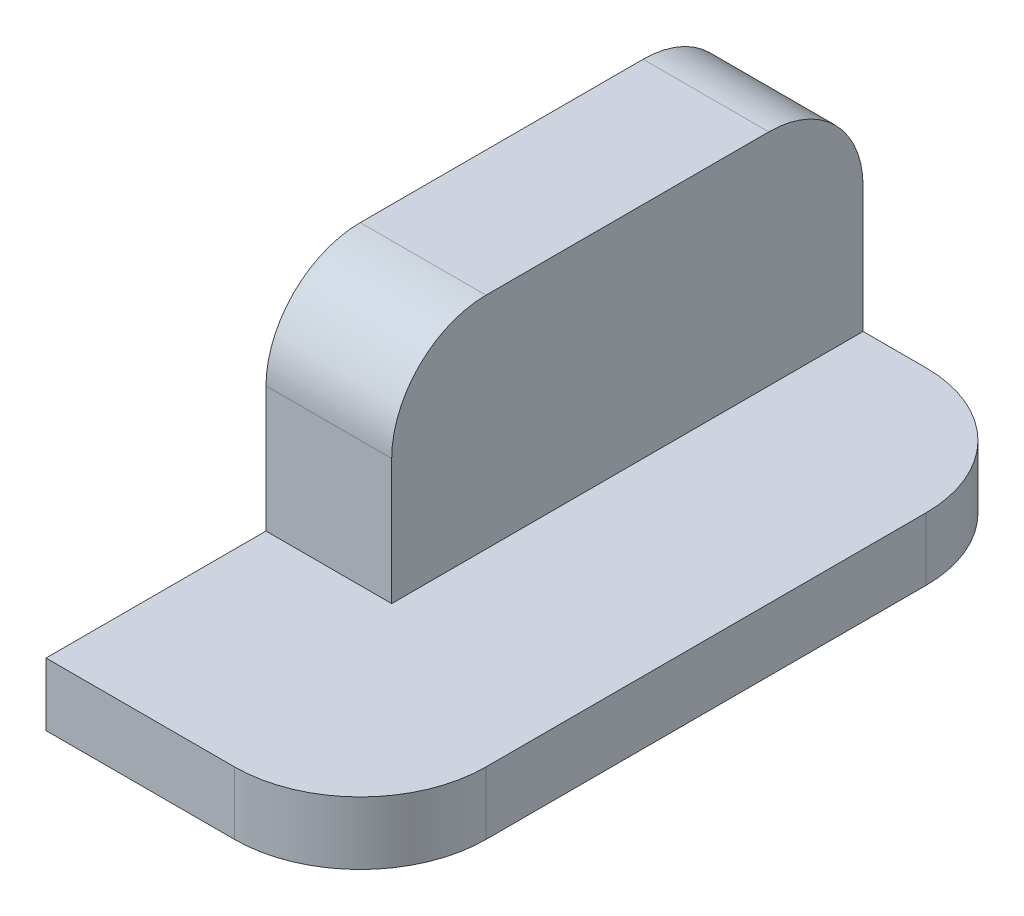
ISO-10303-21;
HEADER;
FILE_DESCRIPTION(('STEP AP214'),'2;1');
FILE_NAME('part.step','',(''),(''),'','','');
FILE_SCHEMA(('AUTOMOTIVE_DESIGN { 1 0 10303 214 1 1 1 1 }'));
ENDSEC;
DATA;
#1=APPLICATION_CONTEXT('core data for automotive mechanical design processes');
#2=APPLICATION_PROTOCOL_DEFINITION('international standard','automotive_design',2000,#1);
#3=PRODUCT_CONTEXT('',#1,'mechanical');
#4=PRODUCT('Part','Part','',(#3));
#5=PRODUCT_RELATED_PRODUCT_CATEGORY('part','',(#4));
#6=PRODUCT_DEFINITION_FORMATION('','',#4);
#7=PRODUCT_DEFINITION_CONTEXT('part definition',#1,'design');
#8=PRODUCT_DEFINITION('design','',#6,#7);
#9=PRODUCT_DEFINITION_SHAPE('','',#8);
#10=(LENGTH_UNIT() NAMED_UNIT(*) SI_UNIT(.MILLI.,.METRE.));
#11=(NAMED_UNIT(*) PLANE_ANGLE_UNIT() SI_UNIT($,.RADIAN.));
#12=(NAMED_UNIT(*) SI_UNIT($,.STERADIAN.) SOLID_ANGLE_UNIT());
#13=UNCERTAINTY_MEASURE_WITH_UNIT(LENGTH_MEASURE(1.E-05),#10,'distance_accuracy_value','');
#14=(GEOMETRIC_REPRESENTATION_CONTEXT(3) GLOBAL_UNCERTAINTY_ASSIGNED_CONTEXT((#13)) GLOBAL_UNIT_ASSIGNED_CONTEXT((#10,
#11,#12)) REPRESENTATION_CONTEXT('',''));
#15=CARTESIAN_POINT('',(0.,0.,0.));
#16=DIRECTION('',(0.,0.,1.));
#17=DIRECTION('',(1.,0.,0.));
#18=AXIS2_PLACEMENT_3D('',#15,#16,#17);
#19=CARTESIAN_POINT('',(50.,0.,0.));
#20=DIRECTION('',(0.,0.,-1.));
#21=DIRECTION('',(0.,1.,0.));
#22=AXIS2_PLACEMENT_3D('',#19,#20,#21);
#23=PLANE('',#22);
#24=DIRECTION('',(-1.,0.,0.));
#25=VECTOR('',#24,1.);
#26=CARTESIAN_POINT('',(50.,-10.,0.));
#27=LINE('',#26,#25);
#28=CARTESIAN_POINT('',(30.,-10.,0.));
#29=VERTEX_POINT('',#28);
#30=CARTESIAN_POINT('',(0.,-10.,0.));
#31=VERTEX_POINT('',#30);
#32=EDGE_CURVE('E146',#29,#31,#27,.T.);
#33=ORIENTED_EDGE('',*,*,#32,.F.);
#34=DIRECTION('',(0.,-1.,0.));
#35=VECTOR('',#34,1.);
#36=CARTESIAN_POINT('',(30.,0.,0.));
#37=LINE('',#36,#35);
#38=CARTESIAN_POINT('',(30.,0.,0.));
#39=VERTEX_POINT('',#38);
#40=EDGE_CURVE('E11',#29,#39,#37,.F.);
#41=ORIENTED_EDGE('',*,*,#40,.T.);
#42=DIRECTION('',(-1.,0.,0.));
#43=VECTOR('',#42,1.);
#44=CARTESIAN_POINT('',(50.,0.,0.));
#45=LINE('',#44,#43);
#46=CARTESIAN_POINT('',(0.,0.,0.));
#47=VERTEX_POINT('',#46);
#48=EDGE_CURVE('E144',#39,#47,#45,.T.);
#49=ORIENTED_EDGE('',*,*,#48,.T.);
#50=DIRECTION('',(0.,-1.,0.));
#51=VECTOR('',#50,1.);
#52=CARTESIAN_POINT('',(0.,0.,0.));
#53=LINE('',#52,#51);
#54=EDGE_CURVE('E197',#47,#31,#53,.T.);
#55=ORIENTED_EDGE('',*,*,#54,.T.);
#56=EDGE_LOOP('',(#33,#41,#49,#55));
#57=FACE_BOUND('',#56,.T.);
#58=ADVANCED_FACE('F33',(#57),#23,.F.);
#59=CARTESIAN_POINT('',(50.,-10.,0.));
#60=DIRECTION('',(0.,1.,0.));
#61=DIRECTION('',(0.,0.,1.));
#62=AXIS2_PLACEMENT_3D('',#59,#60,#61);
#63=PLANE('',#62);
#64=DIRECTION('',(-1.,0.,0.));
#65=VECTOR('',#64,1.);
#66=CARTESIAN_POINT('',(50.,-10.,-110.));
#67=LINE('',#66,#65);
#68=CARTESIAN_POINT('',(30.,-10.,-110.));
#69=VERTEX_POINT('',#68);
#70=CARTESIAN_POINT('',(0.,-10.,-110.));
#71=VERTEX_POINT('',#70);
#72=EDGE_CURVE('E143',#69,#71,#67,.T.);
#73=ORIENTED_EDGE('',*,*,#72,.F.);
#74=CARTESIAN_POINT('',(30.,-10.,-90.));
#75=DIRECTION('',(0.,1.,0.));
#76=DIRECTION('',(0.,0.,1.));
#77=AXIS2_PLACEMENT_3D('',#74,#75,#76);
#78=CIRCLE('',#77,20.);
#79=CARTESIAN_POINT('',(50.,-10.,-90.));
#80=VERTEX_POINT('',#79);
#81=EDGE_CURVE('E41',#69,#80,#78,.F.);
#82=ORIENTED_EDGE('',*,*,#81,.T.);
#83=DIRECTION('',(0.,0.,-1.));
#84=VECTOR('',#83,1.);
#85=CARTESIAN_POINT('',(50.,-10.,0.));
#86=LINE('',#85,#84);
#87=CARTESIAN_POINT('',(50.,-10.,-20.));
#88=VERTEX_POINT('',#87);
#89=EDGE_CURVE('E183',#88,#80,#86,.T.);
#90=ORIENTED_EDGE('',*,*,#89,.F.);
#91=CARTESIAN_POINT('',(30.,-10.,-20.));
#92=DIRECTION('',(0.,1.,0.));
#93=DIRECTION('',(0.,0.,1.));
#94=AXIS2_PLACEMENT_3D('',#91,#92,#93);
#95=CIRCLE('',#94,20.);
#96=EDGE_CURVE('E48',#88,#29,#95,.F.);
#97=ORIENTED_EDGE('',*,*,#96,.T.);
#98=ORIENTED_EDGE('',*,*,#32,.T.);
#99=DIRECTION('',(0.,0.,-1.));
#100=VECTOR('',#99,1.);
#101=CARTESIAN_POINT('',(0.,-10.,0.));
#102=LINE('',#101,#100);
#103=EDGE_CURVE('E204',#31,#71,#102,.T.);
#104=ORIENTED_EDGE('',*,*,#103,.T.);
#105=EDGE_LOOP('',(#73,#82,#90,#97,#98,#104));
#106=FACE_BOUND('',#105,.T.);
#107=ADVANCED_FACE('F182',(#106),#63,.F.);
#108=CARTESIAN_POINT('',(50.,-10.,-110.));
#109=DIRECTION('',(0.,0.,1.));
#110=DIRECTION('',(1.,0.,0.));
#111=AXIS2_PLACEMENT_3D('',#108,#109,#110);
#112=PLANE('',#111);
#113=DIRECTION('',(1.,0.,0.));
#114=VECTOR('',#113,1.);
#115=CARTESIAN_POINT('',(50.,0.,-110.));
#116=LINE('',#115,#114);
#117=CARTESIAN_POINT('',(20.,0.,-110.));
#118=VERTEX_POINT('',#117);
#119=CARTESIAN_POINT('',(30.,0.,-110.));
#120=VERTEX_POINT('',#119);
#121=EDGE_CURVE('E138',#118,#120,#116,.T.);
#122=ORIENTED_EDGE('',*,*,#121,.T.);
#123=DIRECTION('',(0.,1.,0.));
#124=VECTOR('',#123,1.);
#125=CARTESIAN_POINT('',(30.,-10.,-110.));
#126=LINE('',#125,#124);
#127=EDGE_CURVE('E56',#120,#69,#126,.F.);
#128=ORIENTED_EDGE('',*,*,#127,.T.);
#129=ORIENTED_EDGE('',*,*,#72,.T.);
#130=DIRECTION('',(0.,1.,0.));
#131=VECTOR('',#130,1.);
#132=CARTESIAN_POINT('',(0.,-10.,-110.));
#133=LINE('',#132,#131);
#134=CARTESIAN_POINT('',(0.,20.,-110.));
#135=VERTEX_POINT('',#134);
#136=EDGE_CURVE('E206',#71,#135,#133,.T.);
#137=ORIENTED_EDGE('',*,*,#136,.T.);
#138=DIRECTION('',(-1.,0.,0.));
#139=VECTOR('',#138,1.);
#140=CARTESIAN_POINT('',(50.,20.,-110.));
#141=LINE('',#140,#139);
#142=CARTESIAN_POINT('',(20.,20.,-110.));
#143=VERTEX_POINT('',#142);
#144=EDGE_CURVE('E162',#135,#143,#141,.F.);
#145=ORIENTED_EDGE('',*,*,#144,.T.);
#146=DIRECTION('',(0.,-1.,0.));
#147=VECTOR('',#146,1.);
#148=CARTESIAN_POINT('',(20.,-10.,-110.));
#149=LINE('',#148,#147);
#150=EDGE_CURVE('E195',#143,#118,#149,.T.);
#151=ORIENTED_EDGE('',*,*,#150,.T.);
#152=EDGE_LOOP('',(#122,#128,#129,#137,#145,#151));
#153=FACE_BOUND('',#152,.T.);
#154=ADVANCED_FACE('F194',(#153),#112,.F.);
#155=CARTESIAN_POINT('',(50.,35.,-110.));
#156=DIRECTION('',(0.,-1.,0.));
#157=DIRECTION('',(0.,0.,-1.));
#158=AXIS2_PLACEMENT_3D('',#155,#156,#157);
#159=PLANE('',#158);
#160=DIRECTION('',(0.,0.,1.));
#161=VECTOR('',#160,1.);
#162=CARTESIAN_POINT('',(20.,35.,-151.));
#163=LINE('',#162,#161);
#164=CARTESIAN_POINT('',(20.,35.,-95.));
#165=VERTEX_POINT('',#164);
#166=CARTESIAN_POINT('',(20.,35.,-50.));
#167=VERTEX_POINT('',#166);
#168=EDGE_CURVE('E128',#165,#167,#163,.T.);
#169=ORIENTED_EDGE('',*,*,#168,.F.);
#170=DIRECTION('',(-1.,0.,0.));
#171=VECTOR('',#170,1.);
#172=CARTESIAN_POINT('',(50.,35.,-95.));
#173=LINE('',#172,#171);
#174=CARTESIAN_POINT('',(0.,35.,-95.));
#175=VERTEX_POINT('',#174);
#176=EDGE_CURVE('E155',#165,#175,#173,.T.);
#177=ORIENTED_EDGE('',*,*,#176,.T.);
#178=DIRECTION('',(0.,0.,1.));
#179=VECTOR('',#178,1.);
#180=CARTESIAN_POINT('',(0.,35.,-110.));
#181=LINE('',#180,#179);
#182=CARTESIAN_POINT('',(0.,35.,-50.));
#183=VERTEX_POINT('',#182);
#184=EDGE_CURVE('E209',#175,#183,#181,.T.);
#185=ORIENTED_EDGE('',*,*,#184,.T.);
#186=DIRECTION('',(-1.,0.,0.));
#187=VECTOR('',#186,1.);
#188=CARTESIAN_POINT('',(50.,35.,-50.));
#189=LINE('',#188,#187);
#190=EDGE_CURVE('E153',#183,#167,#189,.F.);
#191=ORIENTED_EDGE('',*,*,#190,.T.);
#192=EDGE_LOOP('',(#169,#177,#185,#191));
#193=FACE_BOUND('',#192,.T.);
#194=ADVANCED_FACE('F247',(#193),#159,.F.);
#195=CARTESIAN_POINT('',(50.,35.,-35.));
#196=DIRECTION('',(0.,0.,-1.));
#197=DIRECTION('',(0.,1.,0.));
#198=AXIS2_PLACEMENT_3D('',#195,#196,#197);
#199=PLANE('',#198);
#200=DIRECTION('',(0.,-1.,0.));
#201=VECTOR('',#200,1.);
#202=CARTESIAN_POINT('',(20.,0.,-35.));
#203=LINE('',#202,#201);
#204=CARTESIAN_POINT('',(20.,20.,-35.));
#205=VERTEX_POINT('',#204);
#206=CARTESIAN_POINT('',(20.,0.,-35.));
#207=VERTEX_POINT('',#206);
#208=EDGE_CURVE('E116',#205,#207,#203,.T.);
#209=ORIENTED_EDGE('',*,*,#208,.F.);
#210=DIRECTION('',(-1.,0.,0.));
#211=VECTOR('',#210,1.);
#212=CARTESIAN_POINT('',(50.,20.,-35.));
#213=LINE('',#212,#211);
#214=CARTESIAN_POINT('',(0.,20.,-35.));
#215=VERTEX_POINT('',#214);
#216=EDGE_CURVE('E167',#205,#215,#213,.T.);
#217=ORIENTED_EDGE('',*,*,#216,.T.);
#218=DIRECTION('',(0.,-1.,0.));
#219=VECTOR('',#218,1.);
#220=CARTESIAN_POINT('',(0.,35.,-35.));
#221=LINE('',#220,#219);
#222=CARTESIAN_POINT('',(0.,0.,-35.));
#223=VERTEX_POINT('',#222);
#224=EDGE_CURVE('E142',#215,#223,#221,.T.);
#225=ORIENTED_EDGE('',*,*,#224,.T.);
#226=DIRECTION('',(-1.,0.,0.));
#227=VECTOR('',#226,1.);
#228=CARTESIAN_POINT('',(50.,0.,-35.));
#229=LINE('',#228,#227);
#230=EDGE_CURVE('E136',#207,#223,#229,.T.);
#231=ORIENTED_EDGE('',*,*,#230,.F.);
#232=EDGE_LOOP('',(#209,#217,#225,#231));
#233=FACE_BOUND('',#232,.T.);
#234=ADVANCED_FACE('F140',(#233),#199,.F.);
#235=CARTESIAN_POINT('',(50.,0.,0.));
#236=DIRECTION('',(0.,-1.,0.));
#237=DIRECTION('',(0.,0.,-1.));
#238=AXIS2_PLACEMENT_3D('',#235,#236,#237);
#239=PLANE('',#238);
#240=DIRECTION('',(0.,0.,1.));
#241=VECTOR('',#240,1.);
#242=CARTESIAN_POINT('',(50.,0.,0.));
#243=LINE('',#242,#241);
#244=CARTESIAN_POINT('',(50.,0.,-90.));
#245=VERTEX_POINT('',#244);
#246=CARTESIAN_POINT('',(50.,0.,-20.));
#247=VERTEX_POINT('',#246);
#248=EDGE_CURVE('E148',#245,#247,#243,.T.);
#249=ORIENTED_EDGE('',*,*,#248,.F.);
#250=CARTESIAN_POINT('',(30.,0.,-90.));
#251=DIRECTION('',(0.,-1.,0.));
#252=DIRECTION('',(0.,0.,-1.));
#253=AXIS2_PLACEMENT_3D('',#250,#251,#252);
#254=CIRCLE('',#253,20.);
#255=EDGE_CURVE('E177',#245,#120,#254,.F.);
#256=ORIENTED_EDGE('',*,*,#255,.T.);
#257=ORIENTED_EDGE('',*,*,#121,.F.);
#258=DIRECTION('',(0.,0.,1.));
#259=VECTOR('',#258,1.);
#260=CARTESIAN_POINT('',(20.,0.,-151.));
#261=LINE('',#260,#259);
#262=EDGE_CURVE('E120',#118,#207,#261,.T.);
#263=ORIENTED_EDGE('',*,*,#262,.T.);
#264=ORIENTED_EDGE('',*,*,#230,.T.);
#265=DIRECTION('',(0.,0.,1.));
#266=VECTOR('',#265,1.);
#267=CARTESIAN_POINT('',(0.,0.,0.));
#268=LINE('',#267,#266);
#269=EDGE_CURVE('E191',#223,#47,#268,.T.);
#270=ORIENTED_EDGE('',*,*,#269,.T.);
#271=ORIENTED_EDGE('',*,*,#48,.F.);
#272=CARTESIAN_POINT('',(30.,0.,-20.));
#273=DIRECTION('',(0.,-1.,0.));
#274=DIRECTION('',(0.,0.,-1.));
#275=AXIS2_PLACEMENT_3D('',#272,#273,#274);
#276=CIRCLE('',#275,20.);
#277=EDGE_CURVE('E175',#39,#247,#276,.F.);
#278=ORIENTED_EDGE('',*,*,#277,.T.);
#279=EDGE_LOOP('',(#249,#256,#257,#263,#264,#270,#271,#278));
#280=FACE_BOUND('',#279,.T.);
#281=ADVANCED_FACE('F134',(#280),#239,.F.);
#282=CARTESIAN_POINT('',(50.,0.,0.));
#283=DIRECTION('',(1.,0.,0.));
#284=DIRECTION('',(0.,0.,-1.));
#285=AXIS2_PLACEMENT_3D('',#282,#283,#284);
#286=PLANE('',#285);
#287=ORIENTED_EDGE('',*,*,#89,.T.);
#288=DIRECTION('',(0.,1.,0.));
#289=VECTOR('',#288,1.);
#290=CARTESIAN_POINT('',(50.,0.,-90.));
#291=LINE('',#290,#289);
#292=EDGE_CURVE('E172',#80,#245,#291,.T.);
#293=ORIENTED_EDGE('',*,*,#292,.T.);
#294=ORIENTED_EDGE('',*,*,#248,.T.);
#295=DIRECTION('',(0.,-1.,0.));
#296=VECTOR('',#295,1.);
#297=CARTESIAN_POINT('',(50.,-10.,-20.));
#298=LINE('',#297,#296);
#299=EDGE_CURVE('E169',#247,#88,#298,.T.);
#300=ORIENTED_EDGE('',*,*,#299,.T.);
#301=EDGE_LOOP('',(#287,#293,#294,#300));
#302=FACE_BOUND('',#301,.T.);
#303=ADVANCED_FACE('F188',(#302),#286,.T.);
#304=CARTESIAN_POINT('',(0.,0.,0.));
#305=DIRECTION('',(1.,0.,0.));
#306=DIRECTION('',(0.,0.,-1.));
#307=AXIS2_PLACEMENT_3D('',#304,#305,#306);
#308=PLANE('',#307);
#309=ORIENTED_EDGE('',*,*,#184,.F.);
#310=CARTESIAN_POINT('',(0.,20.,-95.));
#311=DIRECTION('',(1.,0.,0.));
#312=DIRECTION('',(0.,0.,-1.));
#313=AXIS2_PLACEMENT_3D('',#310,#311,#312);
#314=CIRCLE('',#313,15.);
#315=EDGE_CURVE('E160',#175,#135,#314,.F.);
#316=ORIENTED_EDGE('',*,*,#315,.T.);
#317=ORIENTED_EDGE('',*,*,#136,.F.);
#318=ORIENTED_EDGE('',*,*,#103,.F.);
#319=ORIENTED_EDGE('',*,*,#54,.F.);
#320=ORIENTED_EDGE('',*,*,#269,.F.);
#321=ORIENTED_EDGE('',*,*,#224,.F.);
#322=CARTESIAN_POINT('',(0.,20.,-50.));
#323=DIRECTION('',(1.,0.,0.));
#324=DIRECTION('',(0.,0.,-1.));
#325=AXIS2_PLACEMENT_3D('',#322,#323,#324);
#326=CIRCLE('',#325,15.);
#327=EDGE_CURVE('E158',#215,#183,#326,.F.);
#328=ORIENTED_EDGE('',*,*,#327,.T.);
#329=EDGE_LOOP('',(#309,#316,#317,#318,#319,#320,#321,#328));
#330=FACE_BOUND('',#329,.T.);
#331=ADVANCED_FACE('F218',(#330),#308,.F.);
#332=CARTESIAN_POINT('',(20.,0.,-151.));
#333=DIRECTION('',(-1.,0.,0.));
#334=DIRECTION('',(0.,0.,1.));
#335=AXIS2_PLACEMENT_3D('',#332,#333,#334);
#336=PLANE('',#335);
#337=ORIENTED_EDGE('',*,*,#150,.F.);
#338=CARTESIAN_POINT('',(20.,20.,-95.));
#339=DIRECTION('',(-1.,0.,0.));
#340=DIRECTION('',(0.,0.,1.));
#341=AXIS2_PLACEMENT_3D('',#338,#339,#340);
#342=CIRCLE('',#341,15.);
#343=EDGE_CURVE('E165',#143,#165,#342,.F.);
#344=ORIENTED_EDGE('',*,*,#343,.T.);
#345=ORIENTED_EDGE('',*,*,#168,.T.);
#346=CARTESIAN_POINT('',(20.,20.,-50.));
#347=DIRECTION('',(-1.,0.,0.));
#348=DIRECTION('',(0.,0.,1.));
#349=AXIS2_PLACEMENT_3D('',#346,#347,#348);
#350=CIRCLE('',#349,15.);
#351=EDGE_CURVE('E123',#167,#205,#350,.F.);
#352=ORIENTED_EDGE('',*,*,#351,.T.);
#353=ORIENTED_EDGE('',*,*,#208,.T.);
#354=ORIENTED_EDGE('',*,*,#262,.F.);
#355=EDGE_LOOP('',(#337,#344,#345,#352,#353,#354));
#356=FACE_BOUND('',#355,.T.);
#357=ADVANCED_FACE('F119',(#356),#336,.F.);
#358=CARTESIAN_POINT('',(50.,20.,-95.));
#359=DIRECTION('',(-1.,0.,0.));
#360=DIRECTION('',(0.,0.,1.));
#361=AXIS2_PLACEMENT_3D('',#358,#359,#360);
#362=CYLINDRICAL_SURFACE('',#361,15.);
#363=ORIENTED_EDGE('',*,*,#343,.F.);
#364=ORIENTED_EDGE('',*,*,#144,.F.);
#365=ORIENTED_EDGE('',*,*,#315,.F.);
#366=ORIENTED_EDGE('',*,*,#176,.F.);
#367=EDGE_LOOP('',(#363,#364,#365,#366));
#368=FACE_BOUND('',#367,.T.);
#369=ADVANCED_FACE('F236',(#368),#362,.T.);
#370=CARTESIAN_POINT('',(50.,20.,-50.));
#371=DIRECTION('',(-1.,0.,0.));
#372=DIRECTION('',(0.,0.,1.));
#373=AXIS2_PLACEMENT_3D('',#370,#371,#372);
#374=CYLINDRICAL_SURFACE('',#373,15.);
#375=ORIENTED_EDGE('',*,*,#351,.F.);
#376=ORIENTED_EDGE('',*,*,#190,.F.);
#377=ORIENTED_EDGE('',*,*,#327,.F.);
#378=ORIENTED_EDGE('',*,*,#216,.F.);
#379=EDGE_LOOP('',(#375,#376,#377,#378));
#380=FACE_BOUND('',#379,.T.);
#381=ADVANCED_FACE('F227',(#380),#374,.T.);
#382=CARTESIAN_POINT('',(30.,0.,-90.));
#383=DIRECTION('',(0.,-1.,0.));
#384=DIRECTION('',(0.,0.,-1.));
#385=AXIS2_PLACEMENT_3D('',#382,#383,#384);
#386=CYLINDRICAL_SURFACE('',#385,20.);
#387=ORIENTED_EDGE('',*,*,#81,.F.);
#388=ORIENTED_EDGE('',*,*,#127,.F.);
#389=ORIENTED_EDGE('',*,*,#255,.F.);
#390=ORIENTED_EDGE('',*,*,#292,.F.);
#391=EDGE_LOOP('',(#387,#388,#389,#390));
#392=FACE_BOUND('',#391,.T.);
#393=ADVANCED_FACE('F193',(#392),#386,.T.);
#394=CARTESIAN_POINT('',(30.,0.,-20.));
#395=DIRECTION('',(0.,1.,0.));
#396=DIRECTION('',(0.,0.,1.));
#397=AXIS2_PLACEMENT_3D('',#394,#395,#396);
#398=CYLINDRICAL_SURFACE('',#397,20.);
#399=ORIENTED_EDGE('',*,*,#277,.F.);
#400=ORIENTED_EDGE('',*,*,#40,.F.);
#401=ORIENTED_EDGE('',*,*,#96,.F.);
#402=ORIENTED_EDGE('',*,*,#299,.F.);
#403=EDGE_LOOP('',(#399,#400,#401,#402));
#404=FACE_BOUND('',#403,.T.);
#405=ADVANCED_FACE('F35',(#404),#398,.T.);
#406=CLOSED_SHELL('',(#58,#107,#154,#194,#234,#281,#303,#331,#357,#369,#381,#393,#405));
#407=MANIFOLD_SOLID_BREP('B2',#406);
#408=ADVANCED_BREP_SHAPE_REPRESENTATION('',(#18,#407),#14);
#409=SHAPE_DEFINITION_REPRESENTATION(#9,#408);
ENDSEC;
END-ISO-10303-21;
